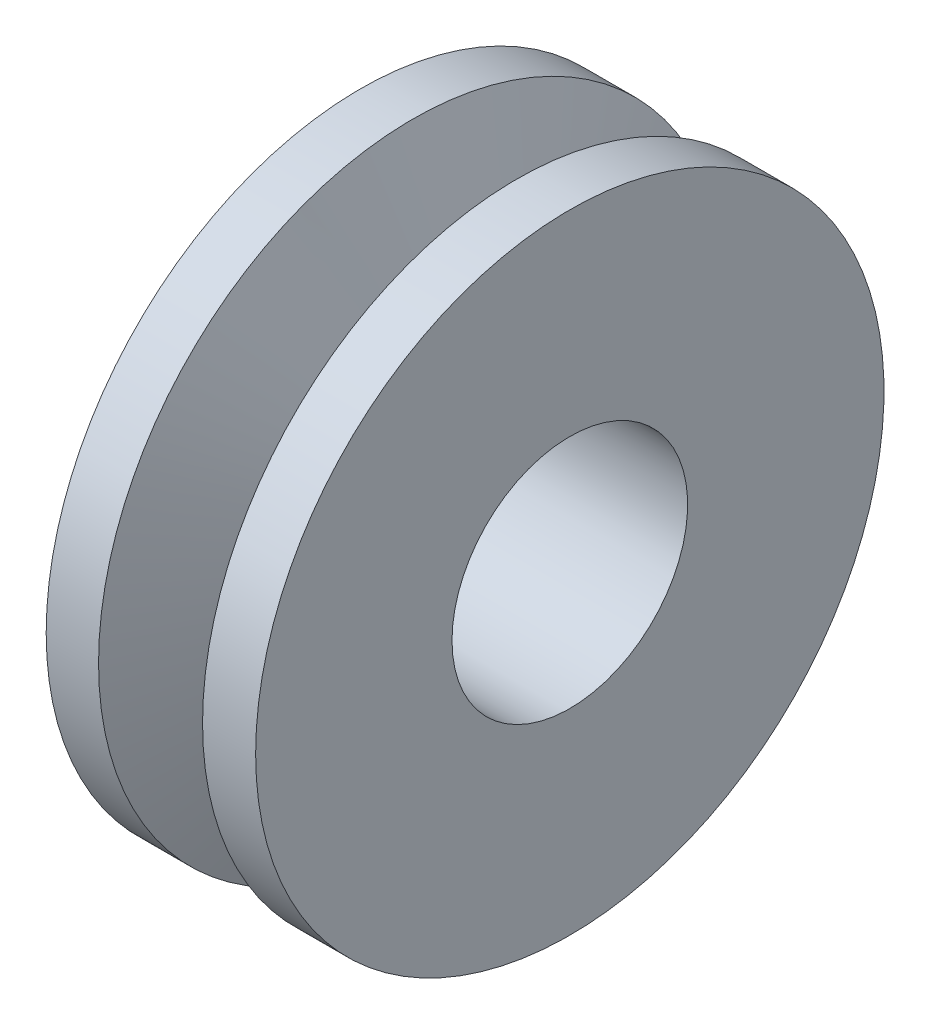
ISO-10303-21;
HEADER;
FILE_DESCRIPTION(('STEP AP214'),'2;1');
FILE_NAME('part.step','',(''),(''),'','','');
FILE_SCHEMA(('AUTOMOTIVE_DESIGN { 1 0 10303 214 1 1 1 1 }'));
ENDSEC;
DATA;
#1=APPLICATION_CONTEXT('core data for automotive mechanical design processes');
#2=APPLICATION_PROTOCOL_DEFINITION('international standard','automotive_design',2000,#1);
#3=PRODUCT_CONTEXT('',#1,'mechanical');
#4=PRODUCT('Part','Part','',(#3));
#5=PRODUCT_RELATED_PRODUCT_CATEGORY('part','',(#4));
#6=PRODUCT_DEFINITION_FORMATION('','',#4);
#7=PRODUCT_DEFINITION_CONTEXT('part definition',#1,'design');
#8=PRODUCT_DEFINITION('design','',#6,#7);
#9=PRODUCT_DEFINITION_SHAPE('','',#8);
#10=(LENGTH_UNIT() NAMED_UNIT(*) SI_UNIT(.MILLI.,.METRE.));
#11=(NAMED_UNIT(*) PLANE_ANGLE_UNIT() SI_UNIT($,.RADIAN.));
#12=(NAMED_UNIT(*) SI_UNIT($,.STERADIAN.) SOLID_ANGLE_UNIT());
#13=UNCERTAINTY_MEASURE_WITH_UNIT(LENGTH_MEASURE(1.E-05),#10,'distance_accuracy_value','');
#14=(GEOMETRIC_REPRESENTATION_CONTEXT(3) GLOBAL_UNCERTAINTY_ASSIGNED_CONTEXT((#13)) GLOBAL_UNIT_ASSIGNED_CONTEXT((#10,
#11,#12)) REPRESENTATION_CONTEXT('',''));
#15=CARTESIAN_POINT('',(0.,0.,0.));
#16=DIRECTION('',(0.,0.,1.));
#17=DIRECTION('',(1.,0.,0.));
#18=AXIS2_PLACEMENT_3D('',#15,#16,#17);
#19=CARTESIAN_POINT('',(2.4654658089245,0.,0.));
#20=DIRECTION('',(1.,0.,0.));
#21=DIRECTION('',(0.,0.,-1.));
#22=AXIS2_PLACEMENT_3D('',#19,#20,#21);
#23=CONICAL_SURFACE('',#22,15.,1.18055617443573);
#24=CARTESIAN_POINT('',(0.,0.,0.));
#25=DIRECTION('',(-1.,0.,0.));
#26=DIRECTION('',(0.,0.,1.));
#27=AXIS2_PLACEMENT_3D('',#24,#25,#26);
#28=CIRCLE('',#27,9.0061950089507);
#29=CARTESIAN_POINT('',(0.,0.,9.0061950089507));
#30=VERTEX_POINT('',#29);
#31=EDGE_CURVE('E10',#30,#30,#28,.T.);
#32=ORIENTED_EDGE('',*,*,#31,.F.);
#33=EDGE_LOOP('',(#32));
#34=FACE_BOUND('',#33,.T.);
#35=CARTESIAN_POINT('',(2.4654658089245,0.,0.));
#36=DIRECTION('',(-1.,0.,0.));
#37=DIRECTION('',(0.,0.,1.));
#38=AXIS2_PLACEMENT_3D('',#35,#36,#37);
#39=CIRCLE('',#38,15.);
#40=CARTESIAN_POINT('',(2.4654658089245,0.,15.));
#41=VERTEX_POINT('',#40);
#42=EDGE_CURVE('E56',#41,#41,#39,.T.);
#43=ORIENTED_EDGE('',*,*,#42,.T.);
#44=EDGE_LOOP('',(#43));
#45=FACE_BOUND('',#44,.T.);
#46=ADVANCED_FACE('F31',(#34,#45),#23,.T.);
#47=CARTESIAN_POINT('',(0.,0.,0.));
#48=DIRECTION('',(-1.,0.,0.));
#49=DIRECTION('',(0.,0.,1.));
#50=AXIS2_PLACEMENT_3D('',#47,#48,#49);
#51=CONICAL_SURFACE('',#50,9.0061950089507,1.17563831575661);
#52=CARTESIAN_POINT('',(-2.5,0.,0.));
#53=DIRECTION('',(-1.,0.,0.));
#54=DIRECTION('',(0.,0.,1.));
#55=AXIS2_PLACEMENT_3D('',#52,#53,#54);
#56=CIRCLE('',#55,15.);
#57=CARTESIAN_POINT('',(-2.5,0.,15.));
#58=VERTEX_POINT('',#57);
#59=EDGE_CURVE('E37',#58,#58,#56,.T.);
#60=ORIENTED_EDGE('',*,*,#59,.F.);
#61=EDGE_LOOP('',(#60));
#62=FACE_BOUND('',#61,.T.);
#63=ORIENTED_EDGE('',*,*,#31,.T.);
#64=EDGE_LOOP('',(#63));
#65=FACE_BOUND('',#64,.T.);
#66=ADVANCED_FACE('F87',(#62,#65),#51,.T.);
#67=CARTESIAN_POINT('',(-5.,0.,0.));
#68=DIRECTION('',(-1.,0.,0.));
#69=DIRECTION('',(0.,0.,1.));
#70=AXIS2_PLACEMENT_3D('',#67,#68,#69);
#71=CYLINDRICAL_SURFACE('',#70,15.);
#72=CARTESIAN_POINT('',(-5.,0.,0.));
#73=DIRECTION('',(-1.,0.,0.));
#74=DIRECTION('',(0.,0.,1.));
#75=AXIS2_PLACEMENT_3D('',#72,#73,#74);
#76=CIRCLE('',#75,15.);
#77=CARTESIAN_POINT('',(-5.,0.,15.));
#78=VERTEX_POINT('',#77);
#79=EDGE_CURVE('E41',#78,#78,#76,.T.);
#80=ORIENTED_EDGE('',*,*,#79,.F.);
#81=EDGE_LOOP('',(#80));
#82=FACE_BOUND('',#81,.T.);
#83=ORIENTED_EDGE('',*,*,#59,.T.);
#84=EDGE_LOOP('',(#83));
#85=FACE_BOUND('',#84,.T.);
#86=ADVANCED_FACE('F82',(#82,#85),#71,.T.);
#87=CARTESIAN_POINT('',(-5.,5.625,0.));
#88=DIRECTION('',(1.,0.,0.));
#89=DIRECTION('',(0.,0.,-1.));
#90=AXIS2_PLACEMENT_3D('',#87,#88,#89);
#91=PLANE('',#90);
#92=CARTESIAN_POINT('',(-5.,0.,0.));
#93=DIRECTION('',(-1.,0.,0.));
#94=DIRECTION('',(0.,0.,1.));
#95=AXIS2_PLACEMENT_3D('',#92,#93,#94);
#96=CIRCLE('',#95,5.625);
#97=CARTESIAN_POINT('',(-5.,0.,5.625));
#98=VERTEX_POINT('',#97);
#99=EDGE_CURVE('E45',#98,#98,#96,.T.);
#100=ORIENTED_EDGE('',*,*,#99,.F.);
#101=EDGE_LOOP('',(#100));
#102=FACE_BOUND('',#101,.T.);
#103=ORIENTED_EDGE('',*,*,#79,.T.);
#104=EDGE_LOOP('',(#103));
#105=FACE_BOUND('',#104,.T.);
#106=ADVANCED_FACE('F76',(#102,#105),#91,.F.);
#107=CARTESIAN_POINT('',(-5.,0.,0.));
#108=DIRECTION('',(-1.,0.,0.));
#109=DIRECTION('',(0.,0.,1.));
#110=AXIS2_PLACEMENT_3D('',#107,#108,#109);
#111=CYLINDRICAL_SURFACE('',#110,5.625);
#112=CARTESIAN_POINT('',(5.,0.,0.));
#113=DIRECTION('',(-1.,0.,0.));
#114=DIRECTION('',(0.,0.,1.));
#115=AXIS2_PLACEMENT_3D('',#112,#113,#114);
#116=CIRCLE('',#115,5.625);
#117=CARTESIAN_POINT('',(5.,0.,5.625));
#118=VERTEX_POINT('',#117);
#119=EDGE_CURVE('E50',#118,#118,#116,.T.);
#120=ORIENTED_EDGE('',*,*,#119,.F.);
#121=EDGE_LOOP('',(#120));
#122=FACE_BOUND('',#121,.T.);
#123=ORIENTED_EDGE('',*,*,#99,.T.);
#124=EDGE_LOOP('',(#123));
#125=FACE_BOUND('',#124,.T.);
#126=ADVANCED_FACE('F70',(#122,#125),#111,.F.);
#127=CARTESIAN_POINT('',(5.,15.,0.));
#128=DIRECTION('',(-1.,0.,0.));
#129=DIRECTION('',(0.,0.,1.));
#130=AXIS2_PLACEMENT_3D('',#127,#128,#129);
#131=PLANE('',#130);
#132=CARTESIAN_POINT('',(5.,0.,0.));
#133=DIRECTION('',(-1.,0.,0.));
#134=DIRECTION('',(0.,0.,1.));
#135=AXIS2_PLACEMENT_3D('',#132,#133,#134);
#136=CIRCLE('',#135,15.);
#137=CARTESIAN_POINT('',(5.,0.,15.));
#138=VERTEX_POINT('',#137);
#139=EDGE_CURVE('E53',#138,#138,#136,.T.);
#140=ORIENTED_EDGE('',*,*,#139,.F.);
#141=EDGE_LOOP('',(#140));
#142=FACE_BOUND('',#141,.T.);
#143=ORIENTED_EDGE('',*,*,#119,.T.);
#144=EDGE_LOOP('',(#143));
#145=FACE_BOUND('',#144,.T.);
#146=ADVANCED_FACE('F64',(#142,#145),#131,.F.);
#147=CARTESIAN_POINT('',(-5.,0.,0.));
#148=DIRECTION('',(-1.,0.,0.));
#149=DIRECTION('',(0.,0.,1.));
#150=AXIS2_PLACEMENT_3D('',#147,#148,#149);
#151=CYLINDRICAL_SURFACE('',#150,15.);
#152=ORIENTED_EDGE('',*,*,#42,.F.);
#153=EDGE_LOOP('',(#152));
#154=FACE_BOUND('',#153,.T.);
#155=ORIENTED_EDGE('',*,*,#139,.T.);
#156=EDGE_LOOP('',(#155));
#157=FACE_BOUND('',#156,.T.);
#158=ADVANCED_FACE('F61',(#154,#157),#151,.T.);
#159=CLOSED_SHELL('',(#46,#66,#86,#106,#126,#146,#158));
#160=MANIFOLD_SOLID_BREP('B2',#159);
#161=ADVANCED_BREP_SHAPE_REPRESENTATION('',(#18,#160),#14);
#162=SHAPE_DEFINITION_REPRESENTATION(#9,#161);
ENDSEC;
END-ISO-10303-21;
